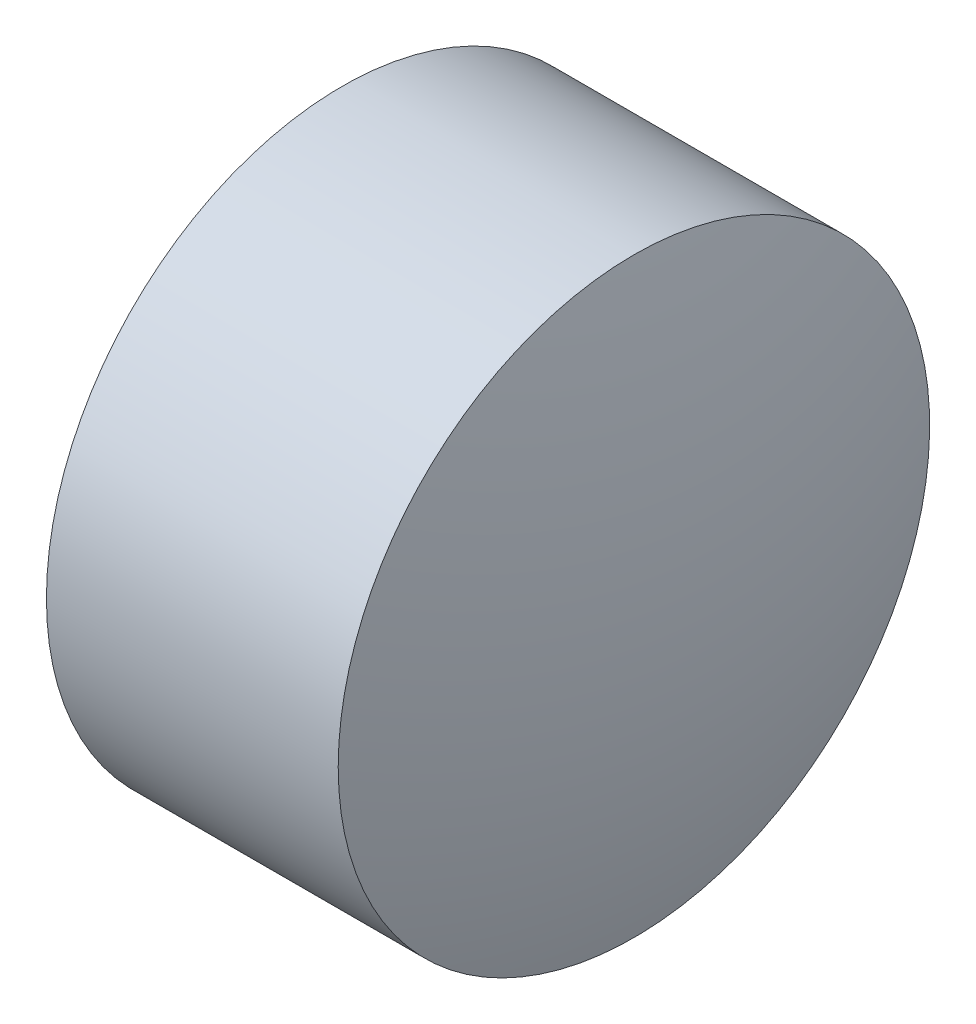
ISO-10303-21;
HEADER;
FILE_DESCRIPTION(('STEP AP214'),'2;1');
FILE_NAME('part.step','',(''),(''),'','','');
FILE_SCHEMA(('AUTOMOTIVE_DESIGN { 1 0 10303 214 1 1 1 1 }'));
ENDSEC;
DATA;
#1=APPLICATION_CONTEXT('core data for automotive mechanical design processes');
#2=APPLICATION_PROTOCOL_DEFINITION('international standard','automotive_design',2000,#1);
#3=PRODUCT_CONTEXT('',#1,'mechanical');
#4=PRODUCT('Part','Part','',(#3));
#5=PRODUCT_RELATED_PRODUCT_CATEGORY('part','',(#4));
#6=PRODUCT_DEFINITION_FORMATION('','',#4);
#7=PRODUCT_DEFINITION_CONTEXT('part definition',#1,'design');
#8=PRODUCT_DEFINITION('design','',#6,#7);
#9=PRODUCT_DEFINITION_SHAPE('','',#8);
#10=(LENGTH_UNIT() NAMED_UNIT(*) SI_UNIT(.MILLI.,.METRE.));
#11=(NAMED_UNIT(*) PLANE_ANGLE_UNIT() SI_UNIT($,.RADIAN.));
#12=(NAMED_UNIT(*) SI_UNIT($,.STERADIAN.) SOLID_ANGLE_UNIT());
#13=UNCERTAINTY_MEASURE_WITH_UNIT(LENGTH_MEASURE(1.E-05),#10,'distance_accuracy_value','');
#14=(GEOMETRIC_REPRESENTATION_CONTEXT(3) GLOBAL_UNCERTAINTY_ASSIGNED_CONTEXT((#13)) GLOBAL_UNIT_ASSIGNED_CONTEXT((#10,
#11,#12)) REPRESENTATION_CONTEXT('',''));
#15=CARTESIAN_POINT('',(0.,0.,0.));
#16=DIRECTION('',(0.,0.,1.));
#17=DIRECTION('',(1.,0.,0.));
#18=AXIS2_PLACEMENT_3D('',#15,#16,#17);
#19=CARTESIAN_POINT('',(583.138328888046,192.342178514974,0.));
#20=DIRECTION('',(-1.,0.,0.));
#21=DIRECTION('',(0.,1.,0.));
#22=AXIS2_PLACEMENT_3D('',#19,#20,#21);
#23=SPHERICAL_SURFACE('',#22,5.22363636363645);
#24=CARTESIAN_POINT('',(588.141965251682,192.342178514974,0.));
#25=DIRECTION('',(-1.,0.,0.));
#26=DIRECTION('',(0.,0.,1.));
#27=AXIS2_PLACEMENT_3D('',#24,#25,#26);
#28=CIRCLE('',#27,1.5);
#29=CARTESIAN_POINT('',(588.141965251682,192.342178514974,1.5));
#30=VERTEX_POINT('',#29);
#31=EDGE_CURVE('E10',#30,#30,#28,.T.);
#32=ORIENTED_EDGE('',*,*,#31,.F.);
#33=EDGE_LOOP('',(#32));
#34=FACE_BOUND('',#33,.T.);
#35=ADVANCED_FACE('F33',(#34),#23,.T.);
#36=CARTESIAN_POINT('',(586.522561633526,192.342178514974,0.));
#37=DIRECTION('',(-1.,0.,0.));
#38=DIRECTION('',(0.,0.,1.));
#39=AXIS2_PLACEMENT_3D('',#36,#37,#38);
#40=CYLINDRICAL_SURFACE('',#39,1.5);
#41=CARTESIAN_POINT('',(586.661965251682,192.342178514974,0.));
#42=DIRECTION('',(-1.,0.,0.));
#43=DIRECTION('',(0.,0.,1.));
#44=AXIS2_PLACEMENT_3D('',#41,#42,#43);
#45=CIRCLE('',#44,1.5);
#46=CARTESIAN_POINT('',(586.661965251682,192.342178514974,1.5));
#47=VERTEX_POINT('',#46);
#48=EDGE_CURVE('E39',#47,#47,#45,.T.);
#49=ORIENTED_EDGE('',*,*,#48,.F.);
#50=EDGE_LOOP('',(#49));
#51=FACE_BOUND('',#50,.T.);
#52=ORIENTED_EDGE('',*,*,#31,.T.);
#53=EDGE_LOOP('',(#52));
#54=FACE_BOUND('',#53,.T.);
#55=ADVANCED_FACE('F47',(#51,#54),#40,.T.);
#56=CARTESIAN_POINT('',(586.661965251682,193.842178514974,0.));
#57=DIRECTION('',(1.,0.,0.));
#58=DIRECTION('',(0.,0.,-1.));
#59=AXIS2_PLACEMENT_3D('',#56,#57,#58);
#60=PLANE('',#59);
#61=ORIENTED_EDGE('',*,*,#48,.T.);
#62=EDGE_LOOP('',(#61));
#63=FACE_BOUND('',#62,.T.);
#64=ADVANCED_FACE('F45',(#63),#60,.F.);
#65=CLOSED_SHELL('',(#35,#55,#64));
#66=MANIFOLD_SOLID_BREP('B2',#65);
#67=ADVANCED_BREP_SHAPE_REPRESENTATION('',(#18,#66),#14);
#68=SHAPE_DEFINITION_REPRESENTATION(#9,#67);
ENDSEC;
END-ISO-10303-21;
